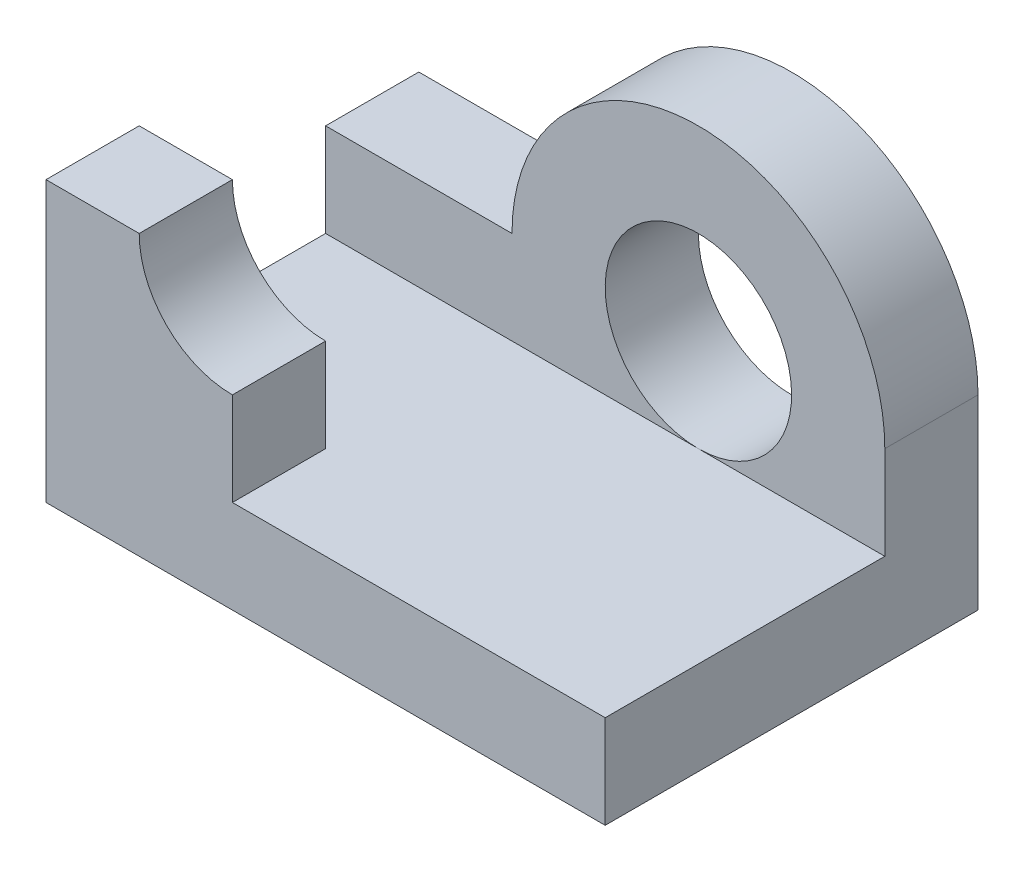
ISO-10303-21;
HEADER;
FILE_DESCRIPTION(('STEP AP214'),'2;1');
FILE_NAME('part.step','',(''),(''),'','','');
FILE_SCHEMA(('AUTOMOTIVE_DESIGN { 1 0 10303 214 1 1 1 1 }'));
ENDSEC;
DATA;
#1=APPLICATION_CONTEXT('core data for automotive mechanical design processes');
#2=APPLICATION_PROTOCOL_DEFINITION('international standard','automotive_design',2000,#1);
#3=PRODUCT_CONTEXT('',#1,'mechanical');
#4=PRODUCT('Part','Part','',(#3));
#5=PRODUCT_RELATED_PRODUCT_CATEGORY('part','',(#4));
#6=PRODUCT_DEFINITION_FORMATION('','',#4);
#7=PRODUCT_DEFINITION_CONTEXT('part definition',#1,'design');
#8=PRODUCT_DEFINITION('design','',#6,#7);
#9=PRODUCT_DEFINITION_SHAPE('','',#8);
#10=(LENGTH_UNIT() NAMED_UNIT(*) SI_UNIT(.MILLI.,.METRE.));
#11=(NAMED_UNIT(*) PLANE_ANGLE_UNIT() SI_UNIT($,.RADIAN.));
#12=(NAMED_UNIT(*) SI_UNIT($,.STERADIAN.) SOLID_ANGLE_UNIT());
#13=UNCERTAINTY_MEASURE_WITH_UNIT(LENGTH_MEASURE(1.E-05),#10,'distance_accuracy_value','');
#14=(GEOMETRIC_REPRESENTATION_CONTEXT(3) GLOBAL_UNCERTAINTY_ASSIGNED_CONTEXT((#13)) GLOBAL_UNIT_ASSIGNED_CONTEXT((#10,
#11,#12)) REPRESENTATION_CONTEXT('',''));
#15=CARTESIAN_POINT('',(0.,0.,0.));
#16=DIRECTION('',(0.,0.,1.));
#17=DIRECTION('',(1.,0.,0.));
#18=AXIS2_PLACEMENT_3D('',#15,#16,#17);
#19=CARTESIAN_POINT('',(0.,0.,254.));
#20=DIRECTION('',(0.,0.,1.));
#21=DIRECTION('',(1.,0.,0.));
#22=AXIS2_PLACEMENT_3D('',#19,#20,#21);
#23=PLANE('',#22);
#24=DIRECTION('',(0.,1.,0.));
#25=VECTOR('',#24,1.);
#26=CARTESIAN_POINT('',(0.,0.,254.));
#27=LINE('',#26,#25);
#28=CARTESIAN_POINT('',(0.,254.,254.));
#29=VERTEX_POINT('',#28);
#30=CARTESIAN_POINT('',(0.,508.,254.));
#31=VERTEX_POINT('',#30);
#32=EDGE_CURVE('E181',#29,#31,#27,.T.);
#33=ORIENTED_EDGE('',*,*,#32,.F.);
#34=DIRECTION('',(1.,0.,0.));
#35=VECTOR('',#34,1.);
#36=CARTESIAN_POINT('',(0.,254.,254.));
#37=LINE('',#36,#35);
#38=CARTESIAN_POINT('',(1016.,254.,254.));
#39=VERTEX_POINT('',#38);
#40=EDGE_CURVE('E50',#29,#39,#37,.T.);
#41=ORIENTED_EDGE('',*,*,#40,.T.);
#42=CARTESIAN_POINT('',(1016.,508.,254.));
#43=DIRECTION('',(0.,0.,1.));
#44=DIRECTION('',(1.,0.,0.));
#45=AXIS2_PLACEMENT_3D('',#42,#43,#44);
#46=CIRCLE('',#45,254.);
#47=EDGE_CURVE('E191',#39,#39,#46,.T.);
#48=ORIENTED_EDGE('',*,*,#47,.F.);
#49=CARTESIAN_POINT('',(1524.,254.,254.));
#50=VERTEX_POINT('',#49);
#51=EDGE_CURVE('E178',#39,#50,#37,.T.);
#52=ORIENTED_EDGE('',*,*,#51,.T.);
#53=DIRECTION('',(0.,1.,0.));
#54=VECTOR('',#53,1.);
#55=CARTESIAN_POINT('',(1524.,-1.33226762955019E-12,254.));
#56=LINE('',#55,#54);
#57=CARTESIAN_POINT('',(1524.,508.,254.));
#58=VERTEX_POINT('',#57);
#59=EDGE_CURVE('E183',#50,#58,#56,.T.);
#60=ORIENTED_EDGE('',*,*,#59,.T.);
#61=CARTESIAN_POINT('',(1016.,508.,254.));
#62=DIRECTION('',(0.,0.,1.));
#63=DIRECTION('',(1.,0.,0.));
#64=AXIS2_PLACEMENT_3D('',#61,#62,#63);
#65=CIRCLE('',#64,508.);
#66=CARTESIAN_POINT('',(508.,508.,254.));
#67=VERTEX_POINT('',#66);
#68=EDGE_CURVE('E186',#58,#67,#65,.T.);
#69=ORIENTED_EDGE('',*,*,#68,.T.);
#70=DIRECTION('',(-1.,0.,0.));
#71=VECTOR('',#70,1.);
#72=CARTESIAN_POINT('',(0.,508.,254.));
#73=LINE('',#72,#71);
#74=EDGE_CURVE('E188',#67,#31,#73,.T.);
#75=ORIENTED_EDGE('',*,*,#74,.T.);
#76=EDGE_LOOP('',(#33,#41,#48,#52,#60,#69,#75));
#77=FACE_BOUND('',#76,.T.);
#78=ADVANCED_FACE('F35',(#77),#23,.T.);
#79=CARTESIAN_POINT('',(0.,0.,254.));
#80=DIRECTION('',(-1.,0.,0.));
#81=DIRECTION('',(0.,0.,1.));
#82=AXIS2_PLACEMENT_3D('',#79,#80,#81);
#83=PLANE('',#82);
#84=DIRECTION('',(0.,1.,0.));
#85=VECTOR('',#84,1.);
#86=CARTESIAN_POINT('',(0.,0.,1016.));
#87=LINE('',#86,#85);
#88=CARTESIAN_POINT('',(0.,0.,1016.));
#89=VERTEX_POINT('',#88);
#90=CARTESIAN_POINT('',(0.,762.,1016.));
#91=VERTEX_POINT('',#90);
#92=EDGE_CURVE('E166',#89,#91,#87,.T.);
#93=ORIENTED_EDGE('',*,*,#92,.T.);
#94=DIRECTION('',(0.,0.,-1.));
#95=VECTOR('',#94,1.);
#96=CARTESIAN_POINT('',(0.,762.,1016.));
#97=LINE('',#96,#95);
#98=CARTESIAN_POINT('',(0.,762.,762.));
#99=VERTEX_POINT('',#98);
#100=EDGE_CURVE('E133',#91,#99,#97,.T.);
#101=ORIENTED_EDGE('',*,*,#100,.T.);
#102=DIRECTION('',(0.,1.,0.));
#103=VECTOR('',#102,1.);
#104=CARTESIAN_POINT('',(0.,0.,762.));
#105=LINE('',#104,#103);
#106=CARTESIAN_POINT('',(0.,254.,762.));
#107=VERTEX_POINT('',#106);
#108=EDGE_CURVE('E153',#107,#99,#105,.T.);
#109=ORIENTED_EDGE('',*,*,#108,.F.);
#110=DIRECTION('',(0.,0.,-1.));
#111=VECTOR('',#110,1.);
#112=CARTESIAN_POINT('',(0.,254.,1016.));
#113=LINE('',#112,#111);
#114=EDGE_CURVE('E58',#107,#29,#113,.T.);
#115=ORIENTED_EDGE('',*,*,#114,.T.);
#116=ORIENTED_EDGE('',*,*,#32,.T.);
#117=DIRECTION('',(0.,0.,-1.));
#118=VECTOR('',#117,1.);
#119=CARTESIAN_POINT('',(0.,508.,254.));
#120=LINE('',#119,#118);
#121=CARTESIAN_POINT('',(0.,508.,0.));
#122=VERTEX_POINT('',#121);
#123=EDGE_CURVE('E193',#31,#122,#120,.T.);
#124=ORIENTED_EDGE('',*,*,#123,.T.);
#125=DIRECTION('',(0.,1.,0.));
#126=VECTOR('',#125,1.);
#127=CARTESIAN_POINT('',(0.,0.,0.));
#128=LINE('',#127,#126);
#129=CARTESIAN_POINT('',(0.,0.,0.));
#130=VERTEX_POINT('',#129);
#131=EDGE_CURVE('E194',#130,#122,#128,.T.);
#132=ORIENTED_EDGE('',*,*,#131,.F.);
#133=DIRECTION('',(0.,0.,-1.));
#134=VECTOR('',#133,1.);
#135=CARTESIAN_POINT('',(0.,0.,254.));
#136=LINE('',#135,#134);
#137=EDGE_CURVE('E11',#89,#130,#136,.T.);
#138=ORIENTED_EDGE('',*,*,#137,.F.);
#139=EDGE_LOOP('',(#93,#101,#109,#115,#116,#124,#132,#138));
#140=FACE_BOUND('',#139,.T.);
#141=ADVANCED_FACE('F37',(#140),#83,.T.);
#142=CARTESIAN_POINT('',(0.,0.,254.));
#143=DIRECTION('',(0.,-1.,0.));
#144=DIRECTION('',(1.,0.,0.));
#145=AXIS2_PLACEMENT_3D('',#142,#143,#144);
#146=PLANE('',#145);
#147=DIRECTION('',(-1.,0.,0.));
#148=VECTOR('',#147,1.);
#149=CARTESIAN_POINT('',(0.,0.,0.));
#150=LINE('',#149,#148);
#151=CARTESIAN_POINT('',(1524.,0.,0.));
#152=VERTEX_POINT('',#151);
#153=EDGE_CURVE('E196',#152,#130,#150,.T.);
#154=ORIENTED_EDGE('',*,*,#153,.F.);
#155=DIRECTION('',(0.,0.,-1.));
#156=VECTOR('',#155,1.);
#157=CARTESIAN_POINT('',(1524.,0.,254.));
#158=LINE('',#157,#156);
#159=CARTESIAN_POINT('',(1524.,0.,1016.));
#160=VERTEX_POINT('',#159);
#161=EDGE_CURVE('E43',#160,#152,#158,.T.);
#162=ORIENTED_EDGE('',*,*,#161,.F.);
#163=DIRECTION('',(-1.,0.,0.));
#164=VECTOR('',#163,1.);
#165=CARTESIAN_POINT('',(0.,0.,1016.));
#166=LINE('',#165,#164);
#167=EDGE_CURVE('E168',#160,#89,#166,.T.);
#168=ORIENTED_EDGE('',*,*,#167,.T.);
#169=ORIENTED_EDGE('',*,*,#137,.T.);
#170=EDGE_LOOP('',(#154,#162,#168,#169));
#171=FACE_BOUND('',#170,.T.);
#172=ADVANCED_FACE('F227',(#171),#146,.T.);
#173=CARTESIAN_POINT('',(1524.,-1.33226762955019E-12,254.));
#174=DIRECTION('',(-1.,0.,0.));
#175=DIRECTION('',(0.,-1.,0.));
#176=AXIS2_PLACEMENT_3D('',#173,#174,#175);
#177=PLANE('',#176);
#178=DIRECTION('',(0.,1.,0.));
#179=VECTOR('',#178,1.);
#180=CARTESIAN_POINT('',(1524.,-1.33226762955019E-12,0.));
#181=LINE('',#180,#179);
#182=CARTESIAN_POINT('',(1524.,508.,0.));
#183=VERTEX_POINT('',#182);
#184=EDGE_CURVE('E199',#152,#183,#181,.T.);
#185=ORIENTED_EDGE('',*,*,#184,.T.);
#186=DIRECTION('',(0.,0.,-1.));
#187=VECTOR('',#186,1.);
#188=CARTESIAN_POINT('',(1524.,508.,254.));
#189=LINE('',#188,#187);
#190=EDGE_CURVE('E213',#58,#183,#189,.T.);
#191=ORIENTED_EDGE('',*,*,#190,.F.);
#192=ORIENTED_EDGE('',*,*,#59,.F.);
#193=DIRECTION('',(0.,0.,-1.));
#194=VECTOR('',#193,1.);
#195=CARTESIAN_POINT('',(1524.,254.,1016.));
#196=LINE('',#195,#194);
#197=CARTESIAN_POINT('',(1524.,254.,1016.));
#198=VERTEX_POINT('',#197);
#199=EDGE_CURVE('E174',#198,#50,#196,.T.);
#200=ORIENTED_EDGE('',*,*,#199,.F.);
#201=DIRECTION('',(0.,-1.,0.));
#202=VECTOR('',#201,1.);
#203=CARTESIAN_POINT('',(1524.,0.,1016.));
#204=LINE('',#203,#202);
#205=EDGE_CURVE('E171',#198,#160,#204,.T.);
#206=ORIENTED_EDGE('',*,*,#205,.T.);
#207=ORIENTED_EDGE('',*,*,#161,.T.);
#208=EDGE_LOOP('',(#185,#191,#192,#200,#206,#207));
#209=FACE_BOUND('',#208,.T.);
#210=ADVANCED_FACE('F217',(#209),#177,.F.);
#211=CARTESIAN_POINT('',(1016.,508.,254.));
#212=DIRECTION('',(0.,0.,-1.));
#213=DIRECTION('',(-1.,0.,0.));
#214=AXIS2_PLACEMENT_3D('',#211,#212,#213);
#215=CYLINDRICAL_SURFACE('',#214,508.);
#216=CARTESIAN_POINT('',(1016.,508.,0.));
#217=DIRECTION('',(0.,0.,1.));
#218=DIRECTION('',(1.,0.,0.));
#219=AXIS2_PLACEMENT_3D('',#216,#217,#218);
#220=CIRCLE('',#219,508.);
#221=CARTESIAN_POINT('',(508.,508.,0.));
#222=VERTEX_POINT('',#221);
#223=EDGE_CURVE('E201',#183,#222,#220,.T.);
#224=ORIENTED_EDGE('',*,*,#223,.T.);
#225=DIRECTION('',(0.,0.,-1.));
#226=VECTOR('',#225,1.);
#227=CARTESIAN_POINT('',(508.,508.,254.));
#228=LINE('',#227,#226);
#229=EDGE_CURVE('E210',#67,#222,#228,.T.);
#230=ORIENTED_EDGE('',*,*,#229,.F.);
#231=ORIENTED_EDGE('',*,*,#68,.F.);
#232=ORIENTED_EDGE('',*,*,#190,.T.);
#233=EDGE_LOOP('',(#224,#230,#231,#232));
#234=FACE_BOUND('',#233,.T.);
#235=ADVANCED_FACE('F236',(#234),#215,.T.);
#236=CARTESIAN_POINT('',(0.,508.,254.));
#237=DIRECTION('',(0.,-1.,0.));
#238=DIRECTION('',(0.,0.,-1.));
#239=AXIS2_PLACEMENT_3D('',#236,#237,#238);
#240=PLANE('',#239);
#241=DIRECTION('',(-1.,0.,0.));
#242=VECTOR('',#241,1.);
#243=CARTESIAN_POINT('',(0.,508.,0.));
#244=LINE('',#243,#242);
#245=EDGE_CURVE('E203',#222,#122,#244,.T.);
#246=ORIENTED_EDGE('',*,*,#245,.T.);
#247=ORIENTED_EDGE('',*,*,#123,.F.);
#248=ORIENTED_EDGE('',*,*,#74,.F.);
#249=ORIENTED_EDGE('',*,*,#229,.T.);
#250=EDGE_LOOP('',(#246,#247,#248,#249));
#251=FACE_BOUND('',#250,.T.);
#252=ADVANCED_FACE('F231',(#251),#240,.F.);
#253=CARTESIAN_POINT('',(1016.,508.,254.));
#254=DIRECTION('',(0.,0.,-1.));
#255=DIRECTION('',(-1.,0.,0.));
#256=AXIS2_PLACEMENT_3D('',#253,#254,#255);
#257=CYLINDRICAL_SURFACE('',#256,254.);
#258=CARTESIAN_POINT('',(1016.,508.,0.));
#259=DIRECTION('',(0.,0.,1.));
#260=DIRECTION('',(1.,0.,0.));
#261=AXIS2_PLACEMENT_3D('',#258,#259,#260);
#262=CIRCLE('',#261,254.);
#263=CARTESIAN_POINT('',(1270.,508.,0.));
#264=VERTEX_POINT('',#263);
#265=EDGE_CURVE('E184',#264,#264,#262,.T.);
#266=ORIENTED_EDGE('',*,*,#265,.F.);
#267=EDGE_LOOP('',(#266));
#268=FACE_BOUND('',#267,.T.);
#269=ORIENTED_EDGE('',*,*,#47,.T.);
#270=EDGE_LOOP('',(#269));
#271=FACE_BOUND('',#270,.T.);
#272=ADVANCED_FACE('F266',(#268,#271),#257,.F.);
#273=CARTESIAN_POINT('',(0.,0.,0.));
#274=DIRECTION('',(0.,0.,1.));
#275=DIRECTION('',(1.,0.,0.));
#276=AXIS2_PLACEMENT_3D('',#273,#274,#275);
#277=PLANE('',#276);
#278=ORIENTED_EDGE('',*,*,#265,.T.);
#279=EDGE_LOOP('',(#278));
#280=FACE_BOUND('',#279,.T.);
#281=ORIENTED_EDGE('',*,*,#131,.T.);
#282=ORIENTED_EDGE('',*,*,#245,.F.);
#283=ORIENTED_EDGE('',*,*,#223,.F.);
#284=ORIENTED_EDGE('',*,*,#184,.F.);
#285=ORIENTED_EDGE('',*,*,#153,.T.);
#286=EDGE_LOOP('',(#281,#282,#283,#284,#285));
#287=FACE_BOUND('',#286,.T.);
#288=ADVANCED_FACE('F225',(#280,#287),#277,.F.);
#289=CARTESIAN_POINT('',(0.,254.,1016.));
#290=DIRECTION('',(0.,-1.,0.));
#291=DIRECTION('',(1.,0.,0.));
#292=AXIS2_PLACEMENT_3D('',#289,#290,#291);
#293=PLANE('',#292);
#294=DIRECTION('',(-1.,0.,0.));
#295=VECTOR('',#294,1.);
#296=CARTESIAN_POINT('',(0.,254.,762.));
#297=LINE('',#296,#295);
#298=CARTESIAN_POINT('',(508.,254.,762.));
#299=VERTEX_POINT('',#298);
#300=EDGE_CURVE('E156',#299,#107,#297,.T.);
#301=ORIENTED_EDGE('',*,*,#300,.F.);
#302=DIRECTION('',(0.,0.,-1.));
#303=VECTOR('',#302,1.);
#304=CARTESIAN_POINT('',(508.,254.,1016.));
#305=LINE('',#304,#303);
#306=CARTESIAN_POINT('',(508.,254.,1016.));
#307=VERTEX_POINT('',#306);
#308=EDGE_CURVE('E162',#307,#299,#305,.T.);
#309=ORIENTED_EDGE('',*,*,#308,.F.);
#310=DIRECTION('',(-1.,0.,0.));
#311=VECTOR('',#310,1.);
#312=CARTESIAN_POINT('',(0.,254.,1016.));
#313=LINE('',#312,#311);
#314=EDGE_CURVE('E132',#198,#307,#313,.T.);
#315=ORIENTED_EDGE('',*,*,#314,.F.);
#316=ORIENTED_EDGE('',*,*,#199,.T.);
#317=ORIENTED_EDGE('',*,*,#51,.F.);
#318=ORIENTED_EDGE('',*,*,#40,.F.);
#319=ORIENTED_EDGE('',*,*,#114,.F.);
#320=EDGE_LOOP('',(#301,#309,#315,#316,#317,#318,#319));
#321=FACE_BOUND('',#320,.T.);
#322=ADVANCED_FACE('F241',(#321),#293,.F.);
#323=CARTESIAN_POINT('',(0.,0.,1016.));
#324=DIRECTION('',(0.,0.,1.));
#325=DIRECTION('',(1.,0.,0.));
#326=AXIS2_PLACEMENT_3D('',#323,#324,#325);
#327=PLANE('',#326);
#328=ORIENTED_EDGE('',*,*,#314,.T.);
#329=DIRECTION('',(0.,-1.,0.));
#330=VECTOR('',#329,1.);
#331=CARTESIAN_POINT('',(508.,0.,1016.));
#332=LINE('',#331,#330);
#333=CARTESIAN_POINT('',(508.,508.,1016.));
#334=VERTEX_POINT('',#333);
#335=EDGE_CURVE('E141',#334,#307,#332,.T.);
#336=ORIENTED_EDGE('',*,*,#335,.F.);
#337=CARTESIAN_POINT('',(508.,762.,1016.));
#338=DIRECTION('',(0.,0.,1.));
#339=DIRECTION('',(1.,0.,0.));
#340=AXIS2_PLACEMENT_3D('',#337,#338,#339);
#341=CIRCLE('',#340,254.);
#342=CARTESIAN_POINT('',(254.,762.,1016.));
#343=VERTEX_POINT('',#342);
#344=EDGE_CURVE('E124',#343,#334,#341,.T.);
#345=ORIENTED_EDGE('',*,*,#344,.F.);
#346=DIRECTION('',(1.,0.,0.));
#347=VECTOR('',#346,1.);
#348=CARTESIAN_POINT('',(3.33066907387547E-13,762.,1016.));
#349=LINE('',#348,#347);
#350=EDGE_CURVE('E140',#91,#343,#349,.T.);
#351=ORIENTED_EDGE('',*,*,#350,.F.);
#352=ORIENTED_EDGE('',*,*,#92,.F.);
#353=ORIENTED_EDGE('',*,*,#167,.F.);
#354=ORIENTED_EDGE('',*,*,#205,.F.);
#355=EDGE_LOOP('',(#328,#336,#345,#351,#352,#353,#354));
#356=FACE_BOUND('',#355,.T.);
#357=ADVANCED_FACE('F138',(#356),#327,.T.);
#358=CARTESIAN_POINT('',(508.,762.,1016.));
#359=DIRECTION('',(0.,0.,-1.));
#360=DIRECTION('',(-1.,0.,0.));
#361=AXIS2_PLACEMENT_3D('',#358,#359,#360);
#362=CYLINDRICAL_SURFACE('',#361,254.);
#363=CARTESIAN_POINT('',(508.,762.,762.));
#364=DIRECTION('',(0.,0.,1.));
#365=DIRECTION('',(1.,0.,0.));
#366=AXIS2_PLACEMENT_3D('',#363,#364,#365);
#367=CIRCLE('',#366,254.);
#368=CARTESIAN_POINT('',(254.,762.,762.));
#369=VERTEX_POINT('',#368);
#370=CARTESIAN_POINT('',(508.,508.,762.));
#371=VERTEX_POINT('',#370);
#372=EDGE_CURVE('E127',#369,#371,#367,.T.);
#373=ORIENTED_EDGE('',*,*,#372,.F.);
#374=DIRECTION('',(0.,0.,-1.));
#375=VECTOR('',#374,1.);
#376=CARTESIAN_POINT('',(254.,762.,1016.));
#377=LINE('',#376,#375);
#378=EDGE_CURVE('E121',#343,#369,#377,.T.);
#379=ORIENTED_EDGE('',*,*,#378,.F.);
#380=ORIENTED_EDGE('',*,*,#344,.T.);
#381=DIRECTION('',(0.,0.,-1.));
#382=VECTOR('',#381,1.);
#383=CARTESIAN_POINT('',(508.,508.,1016.));
#384=LINE('',#383,#382);
#385=EDGE_CURVE('E147',#334,#371,#384,.T.);
#386=ORIENTED_EDGE('',*,*,#385,.T.);
#387=EDGE_LOOP('',(#373,#379,#380,#386));
#388=FACE_BOUND('',#387,.T.);
#389=ADVANCED_FACE('F123',(#388),#362,.F.);
#390=CARTESIAN_POINT('',(3.33066907387547E-13,762.,1016.));
#391=DIRECTION('',(0.,1.,0.));
#392=DIRECTION('',(-1.,0.,0.));
#393=AXIS2_PLACEMENT_3D('',#390,#391,#392);
#394=PLANE('',#393);
#395=DIRECTION('',(1.,0.,0.));
#396=VECTOR('',#395,1.);
#397=CARTESIAN_POINT('',(3.33066907387547E-13,762.,762.));
#398=LINE('',#397,#396);
#399=EDGE_CURVE('E151',#99,#369,#398,.T.);
#400=ORIENTED_EDGE('',*,*,#399,.F.);
#401=ORIENTED_EDGE('',*,*,#100,.F.);
#402=ORIENTED_EDGE('',*,*,#350,.T.);
#403=ORIENTED_EDGE('',*,*,#378,.T.);
#404=EDGE_LOOP('',(#400,#401,#402,#403));
#405=FACE_BOUND('',#404,.T.);
#406=ADVANCED_FACE('F145',(#405),#394,.T.);
#407=CARTESIAN_POINT('',(508.,0.,1016.));
#408=DIRECTION('',(1.,0.,0.));
#409=DIRECTION('',(0.,0.,-1.));
#410=AXIS2_PLACEMENT_3D('',#407,#408,#409);
#411=PLANE('',#410);
#412=DIRECTION('',(0.,-1.,0.));
#413=VECTOR('',#412,1.);
#414=CARTESIAN_POINT('',(508.,0.,762.));
#415=LINE('',#414,#413);
#416=EDGE_CURVE('E142',#371,#299,#415,.T.);
#417=ORIENTED_EDGE('',*,*,#416,.F.);
#418=ORIENTED_EDGE('',*,*,#385,.F.);
#419=ORIENTED_EDGE('',*,*,#335,.T.);
#420=ORIENTED_EDGE('',*,*,#308,.T.);
#421=EDGE_LOOP('',(#417,#418,#419,#420));
#422=FACE_BOUND('',#421,.T.);
#423=ADVANCED_FACE('F247',(#422),#411,.T.);
#424=CARTESIAN_POINT('',(0.,0.,762.));
#425=DIRECTION('',(0.,0.,1.));
#426=DIRECTION('',(1.,0.,0.));
#427=AXIS2_PLACEMENT_3D('',#424,#425,#426);
#428=PLANE('',#427);
#429=ORIENTED_EDGE('',*,*,#372,.T.);
#430=ORIENTED_EDGE('',*,*,#416,.T.);
#431=ORIENTED_EDGE('',*,*,#300,.T.);
#432=ORIENTED_EDGE('',*,*,#108,.T.);
#433=ORIENTED_EDGE('',*,*,#399,.T.);
#434=EDGE_LOOP('',(#429,#430,#431,#432,#433));
#435=FACE_BOUND('',#434,.T.);
#436=ADVANCED_FACE('F244',(#435),#428,.F.);
#437=CLOSED_SHELL('',(#78,#141,#172,#210,#235,#252,#272,#288,#322,#357,#389,#406,#423,#436));
#438=MANIFOLD_SOLID_BREP('B2',#437);
#439=ADVANCED_BREP_SHAPE_REPRESENTATION('',(#18,#438),#14);
#440=SHAPE_DEFINITION_REPRESENTATION(#9,#439);
ENDSEC;
END-ISO-10303-21;
